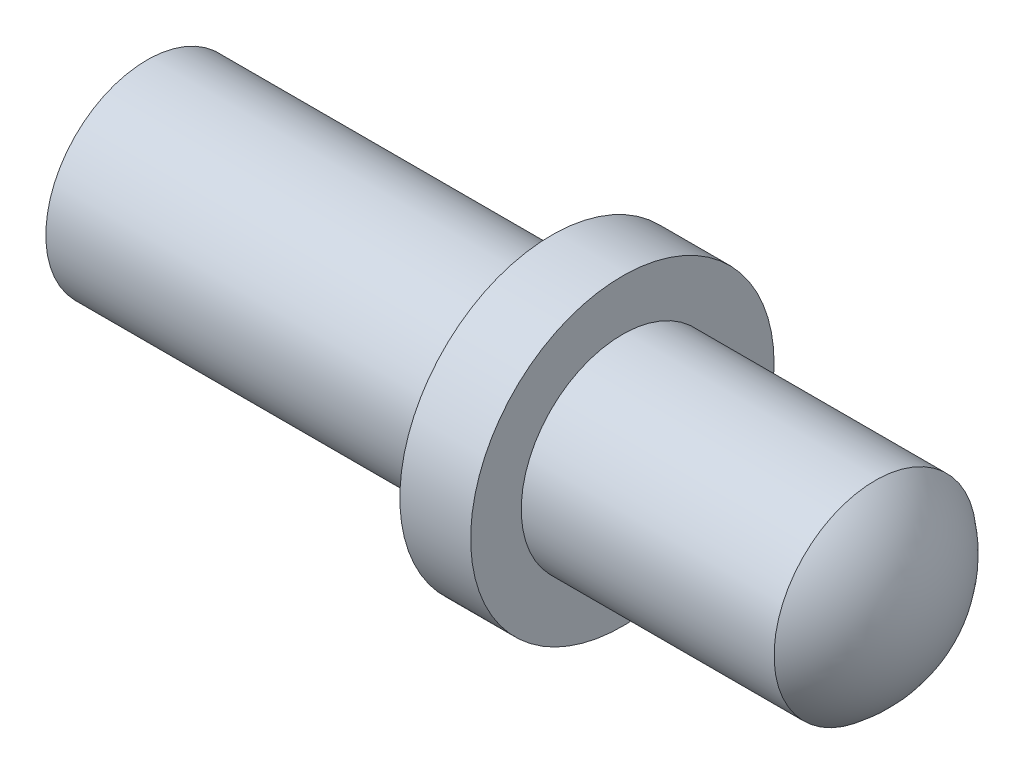
ISO-10303-21;
HEADER;
FILE_DESCRIPTION(('STEP AP214'),'2;1');
FILE_NAME('part.step','',(''),(''),'','','');
FILE_SCHEMA(('AUTOMOTIVE_DESIGN { 1 0 10303 214 1 1 1 1 }'));
ENDSEC;
DATA;
#1=APPLICATION_CONTEXT('core data for automotive mechanical design processes');
#2=APPLICATION_PROTOCOL_DEFINITION('international standard','automotive_design',2000,#1);
#3=PRODUCT_CONTEXT('',#1,'mechanical');
#4=PRODUCT('Part','Part','',(#3));
#5=PRODUCT_RELATED_PRODUCT_CATEGORY('part','',(#4));
#6=PRODUCT_DEFINITION_FORMATION('','',#4);
#7=PRODUCT_DEFINITION_CONTEXT('part definition',#1,'design');
#8=PRODUCT_DEFINITION('design','',#6,#7);
#9=PRODUCT_DEFINITION_SHAPE('','',#8);
#10=(LENGTH_UNIT() NAMED_UNIT(*) SI_UNIT(.MILLI.,.METRE.));
#11=(NAMED_UNIT(*) PLANE_ANGLE_UNIT() SI_UNIT($,.RADIAN.));
#12=(NAMED_UNIT(*) SI_UNIT($,.STERADIAN.) SOLID_ANGLE_UNIT());
#13=UNCERTAINTY_MEASURE_WITH_UNIT(LENGTH_MEASURE(1.E-05),#10,'distance_accuracy_value','');
#14=(GEOMETRIC_REPRESENTATION_CONTEXT(3) GLOBAL_UNCERTAINTY_ASSIGNED_CONTEXT((#13)) GLOBAL_UNIT_ASSIGNED_CONTEXT((#10,
#11,#12)) REPRESENTATION_CONTEXT('',''));
#15=CARTESIAN_POINT('',(0.,0.,0.));
#16=DIRECTION('',(0.,0.,1.));
#17=DIRECTION('',(1.,0.,0.));
#18=AXIS2_PLACEMENT_3D('',#15,#16,#17);
#19=CARTESIAN_POINT('',(0.,0.,0.));
#20=DIRECTION('',(-1.,0.,0.));
#21=DIRECTION('',(0.,0.,1.));
#22=AXIS2_PLACEMENT_3D('',#19,#20,#21);
#23=PLANE('',#22);
#24=CARTESIAN_POINT('',(0.,0.,0.));
#25=DIRECTION('',(1.,0.,0.));
#26=DIRECTION('',(0.,0.,-1.));
#27=AXIS2_PLACEMENT_3D('',#24,#25,#26);
#28=CIRCLE('',#27,2.);
#29=CARTESIAN_POINT('',(0.,0.,-2.));
#30=VERTEX_POINT('',#29);
#31=EDGE_CURVE('E11',#30,#30,#28,.T.);
#32=ORIENTED_EDGE('',*,*,#31,.F.);
#33=EDGE_LOOP('',(#32));
#34=FACE_BOUND('',#33,.T.);
#35=ADVANCED_FACE('F37',(#34),#23,.T.);
#36=CARTESIAN_POINT('',(14.4,0.,0.));
#37=DIRECTION('',(1.,0.,0.));
#38=DIRECTION('',(0.,0.,-1.));
#39=AXIS2_PLACEMENT_3D('',#36,#37,#38);
#40=CYLINDRICAL_SURFACE('',#39,2.);
#41=ORIENTED_EDGE('',*,*,#31,.T.);
#42=EDGE_LOOP('',(#41));
#43=FACE_BOUND('',#42,.T.);
#44=CARTESIAN_POINT('',(8.,0.,0.));
#45=DIRECTION('',(1.,0.,0.));
#46=DIRECTION('',(0.,0.,-1.));
#47=AXIS2_PLACEMENT_3D('',#44,#45,#46);
#48=CIRCLE('',#47,2.);
#49=CARTESIAN_POINT('',(8.,0.,-2.));
#50=VERTEX_POINT('',#49);
#51=EDGE_CURVE('E45',#50,#50,#48,.T.);
#52=ORIENTED_EDGE('',*,*,#51,.F.);
#53=EDGE_LOOP('',(#52));
#54=FACE_BOUND('',#53,.T.);
#55=ADVANCED_FACE('F79',(#43,#54),#40,.T.);
#56=CARTESIAN_POINT('',(8.,2.,0.));
#57=DIRECTION('',(-1.,0.,0.));
#58=DIRECTION('',(0.,0.,1.));
#59=AXIS2_PLACEMENT_3D('',#56,#57,#58);
#60=PLANE('',#59);
#61=ORIENTED_EDGE('',*,*,#51,.T.);
#62=EDGE_LOOP('',(#61));
#63=FACE_BOUND('',#62,.T.);
#64=CARTESIAN_POINT('',(8.,0.,0.));
#65=DIRECTION('',(1.,0.,0.));
#66=DIRECTION('',(0.,0.,-1.));
#67=AXIS2_PLACEMENT_3D('',#64,#65,#66);
#68=CIRCLE('',#67,3.);
#69=CARTESIAN_POINT('',(8.,0.,-3.));
#70=VERTEX_POINT('',#69);
#71=EDGE_CURVE('E49',#70,#70,#68,.T.);
#72=ORIENTED_EDGE('',*,*,#71,.F.);
#73=EDGE_LOOP('',(#72));
#74=FACE_BOUND('',#73,.T.);
#75=ADVANCED_FACE('F84',(#63,#74),#60,.T.);
#76=CARTESIAN_POINT('',(14.4,0.,0.));
#77=DIRECTION('',(1.,0.,0.));
#78=DIRECTION('',(0.,0.,-1.));
#79=AXIS2_PLACEMENT_3D('',#76,#77,#78);
#80=CYLINDRICAL_SURFACE('',#79,3.);
#81=ORIENTED_EDGE('',*,*,#71,.T.);
#82=EDGE_LOOP('',(#81));
#83=FACE_BOUND('',#82,.T.);
#84=CARTESIAN_POINT('',(9.4,0.,0.));
#85=DIRECTION('',(1.,0.,0.));
#86=DIRECTION('',(0.,0.,-1.));
#87=AXIS2_PLACEMENT_3D('',#84,#85,#86);
#88=CIRCLE('',#87,3.);
#89=CARTESIAN_POINT('',(9.4,0.,-3.));
#90=VERTEX_POINT('',#89);
#91=EDGE_CURVE('E55',#90,#90,#88,.T.);
#92=ORIENTED_EDGE('',*,*,#91,.F.);
#93=EDGE_LOOP('',(#92));
#94=FACE_BOUND('',#93,.T.);
#95=ADVANCED_FACE('F75',(#83,#94),#80,.T.);
#96=CARTESIAN_POINT('',(9.4,3.,0.));
#97=DIRECTION('',(1.,0.,0.));
#98=DIRECTION('',(0.,0.,-1.));
#99=AXIS2_PLACEMENT_3D('',#96,#97,#98);
#100=PLANE('',#99);
#101=ORIENTED_EDGE('',*,*,#91,.T.);
#102=EDGE_LOOP('',(#101));
#103=FACE_BOUND('',#102,.T.);
#104=CARTESIAN_POINT('',(9.4,0.,0.));
#105=DIRECTION('',(1.,0.,0.));
#106=DIRECTION('',(0.,0.,-1.));
#107=AXIS2_PLACEMENT_3D('',#104,#105,#106);
#108=CIRCLE('',#107,1.99999999999999);
#109=CARTESIAN_POINT('',(9.4,0.,-1.99999999999999));
#110=VERTEX_POINT('',#109);
#111=EDGE_CURVE('E59',#110,#110,#108,.T.);
#112=ORIENTED_EDGE('',*,*,#111,.F.);
#113=EDGE_LOOP('',(#112));
#114=FACE_BOUND('',#113,.T.);
#115=ADVANCED_FACE('F69',(#103,#114),#100,.T.);
#116=CARTESIAN_POINT('',(14.4,0.,0.));
#117=DIRECTION('',(1.,0.,0.));
#118=DIRECTION('',(0.,0.,-1.));
#119=AXIS2_PLACEMENT_3D('',#116,#117,#118);
#120=CYLINDRICAL_SURFACE('',#119,1.99999999999999);
#121=ORIENTED_EDGE('',*,*,#111,.T.);
#122=EDGE_LOOP('',(#121));
#123=FACE_BOUND('',#122,.T.);
#124=CARTESIAN_POINT('',(14.4,0.,0.));
#125=DIRECTION('',(1.,0.,0.));
#126=DIRECTION('',(0.,0.,-1.));
#127=AXIS2_PLACEMENT_3D('',#124,#125,#126);
#128=CIRCLE('',#127,1.99999999999999);
#129=CARTESIAN_POINT('',(14.4,0.,-1.99999999999999));
#130=VERTEX_POINT('',#129);
#131=EDGE_CURVE('E41',#130,#130,#128,.T.);
#132=ORIENTED_EDGE('',*,*,#131,.F.);
#133=EDGE_LOOP('',(#132));
#134=FACE_BOUND('',#133,.T.);
#135=ADVANCED_FACE('F67',(#123,#134),#120,.T.);
#136=CARTESIAN_POINT('',(12.9,0.,0.));
#137=DIRECTION('',(0.,0.,1.));
#138=DIRECTION('',(1.,0.,0.));
#139=AXIS2_PLACEMENT_3D('',#136,#137,#138);
#140=SPHERICAL_SURFACE('',#139,2.49999999999999);
#141=CARTESIAN_POINT('',(12.9,0.,0.));
#142=DIRECTION('',(1.,0.,0.));
#143=DIRECTION('',(0.,0.,-1.));
#144=AXIS2_PLACEMENT_3D('',#141,#142,#143);
#145=SPHERICAL_SURFACE('',#144,2.49999999999999);
#146=ORIENTED_EDGE('',*,*,#131,.T.);
#147=EDGE_LOOP('',(#146));
#148=FACE_BOUND('',#147,.T.);
#149=ADVANCED_FACE('F39',(#148),#145,.T.);
#150=CLOSED_SHELL('',(#35,#55,#75,#95,#115,#135,#149));
#151=MANIFOLD_SOLID_BREP('B2',#150);
#152=ADVANCED_BREP_SHAPE_REPRESENTATION('',(#18,#151),#14);
#153=SHAPE_DEFINITION_REPRESENTATION(#9,#152);
ENDSEC;
END-ISO-10303-21;
